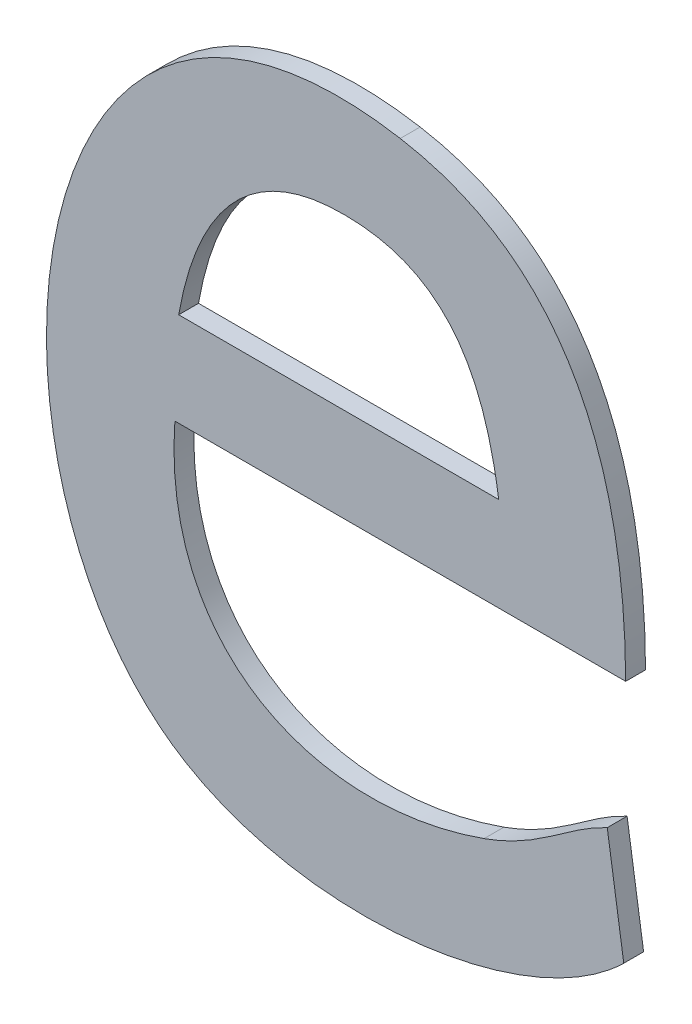
ISO-10303-21;
HEADER;
FILE_DESCRIPTION(('STEP AP214'),'2;1');
FILE_NAME('part.step','',(''),(''),'','','');
FILE_SCHEMA(('AUTOMOTIVE_DESIGN { 1 0 10303 214 1 1 1 1 }'));
ENDSEC;
DATA;
#1=APPLICATION_CONTEXT('core data for automotive mechanical design processes');
#2=APPLICATION_PROTOCOL_DEFINITION('international standard','automotive_design',2000,#1);
#3=PRODUCT_CONTEXT('',#1,'mechanical');
#4=PRODUCT('Part','Part','',(#3));
#5=PRODUCT_RELATED_PRODUCT_CATEGORY('part','',(#4));
#6=PRODUCT_DEFINITION_FORMATION('','',#4);
#7=PRODUCT_DEFINITION_CONTEXT('part definition',#1,'design');
#8=PRODUCT_DEFINITION('design','',#6,#7);
#9=PRODUCT_DEFINITION_SHAPE('','',#8);
#10=(LENGTH_UNIT() NAMED_UNIT(*) SI_UNIT(.MILLI.,.METRE.));
#11=(NAMED_UNIT(*) PLANE_ANGLE_UNIT() SI_UNIT($,.RADIAN.));
#12=(NAMED_UNIT(*) SI_UNIT($,.STERADIAN.) SOLID_ANGLE_UNIT());
#13=UNCERTAINTY_MEASURE_WITH_UNIT(LENGTH_MEASURE(1.E-05),#10,'distance_accuracy_value','');
#14=(GEOMETRIC_REPRESENTATION_CONTEXT(3) GLOBAL_UNCERTAINTY_ASSIGNED_CONTEXT((#13)) GLOBAL_UNIT_ASSIGNED_CONTEXT((#10,
#11,#12)) REPRESENTATION_CONTEXT('',''));
#15=CARTESIAN_POINT('',(0.,0.,0.));
#16=DIRECTION('',(0.,0.,1.));
#17=DIRECTION('',(1.,0.,0.));
#18=AXIS2_PLACEMENT_3D('',#15,#16,#17);
#19=CARTESIAN_POINT('',(-1.892563125,-48.604259609375,0.001));
#20=CARTESIAN_POINT('',(-1.892563125,-48.604259609375,0.));
#21=CARTESIAN_POINT('',(-1.9123662890625,-48.6008684375,0.001));
#22=CARTESIAN_POINT('',(-1.9123662890625,-48.6008684375,0.));
#23=CARTESIAN_POINT('',(-1.91521359375,-48.6298213671875,0.001));
#24=CARTESIAN_POINT('',(-1.91521359375,-48.6298213671875,0.));
#25=CARTESIAN_POINT('',(-1.903376484375,-48.636891640625,0.001));
#26=CARTESIAN_POINT('',(-1.903376484375,-48.636891640625,0.));
#27=B_SPLINE_SURFACE_WITH_KNOTS('',3,1,((#19,#20),(#21,#22),(#23,#24),(#25,#26)),.UNSPECIFIED.,
.F.,.F.,.F.,(4,4),(2,2),(0.5,0.625),(0.,1.),.UNSPECIFIED.);
#28=CARTESIAN_POINT('',(-1.892563125,-48.604259609375,0.));
#29=CARTESIAN_POINT('',(-1.9123662890625,-48.6008684375,0.));
#30=CARTESIAN_POINT('',(-1.91521359375,-48.6298213671875,0.));
#31=CARTESIAN_POINT('',(-1.903376484375,-48.636891640625,0.));
#32=B_SPLINE_CURVE_WITH_KNOTS('',3,(#28,#29,#30,#31),.UNSPECIFIED.,.F.,.F.,(4,4),(0.5,0.625),.UNSPECIFIED.);
#33=CARTESIAN_POINT('',(-1.892563125,-48.604259609375,0.));
#34=VERTEX_POINT('',#33);
#35=CARTESIAN_POINT('',(-1.903376484375,-48.636891640625,0.));
#36=VERTEX_POINT('',#35);
#37=EDGE_CURVE('E11',#34,#36,#32,.T.);
#38=DIRECTION('',(0.,0.,-1.));
#39=VECTOR('',#38,1.);
#40=CARTESIAN_POINT('',(-1.903376484375,-48.636891640625,0.001));
#41=LINE('',#40,#39);
#42=CARTESIAN_POINT('',(-1.903376484375,-48.636891640625,0.001));
#43=VERTEX_POINT('',#42);
#44=EDGE_CURVE('E28',#43,#36,#41,.T.);
#45=CARTESIAN_POINT('',(-1.892563125,-48.604259609375,0.001));
#46=CARTESIAN_POINT('',(-1.9123662890625,-48.6008684375,0.001));
#47=CARTESIAN_POINT('',(-1.91521359375,-48.6298213671875,0.001));
#48=CARTESIAN_POINT('',(-1.903376484375,-48.636891640625,0.001));
#49=B_SPLINE_CURVE_WITH_KNOTS('',3,(#45,#46,#47,#48),.UNSPECIFIED.,.F.,.F.,(4,4),(0.5,0.625),.UNSPECIFIED.);
#50=CARTESIAN_POINT('',(-1.892563125,-48.604259609375,0.001));
#51=VERTEX_POINT('',#50);
#52=EDGE_CURVE('E225',#51,#43,#49,.T.);
#53=DIRECTION('',(0.,0.,-1.));
#54=VECTOR('',#53,1.);
#55=CARTESIAN_POINT('',(-1.892563125,-48.604259609375,0.001));
#56=LINE('',#55,#54);
#57=EDGE_CURVE('E40',#51,#34,#56,.T.);
#58=ORIENTED_EDGE('',*,*,#37,.T.);
#59=ORIENTED_EDGE('',*,*,#44,.F.);
#60=ORIENTED_EDGE('',*,*,#52,.F.);
#61=ORIENTED_EDGE('',*,*,#57,.T.);
#62=EDGE_LOOP('',(#58,#59,#60,#61));
#63=FACE_BOUND('',#62,.T.);
#64=ADVANCED_FACE('F17',(#63),#27,.F.);
#65=CARTESIAN_POINT('',(-1.903376484375,-48.636891640625,0.001));
#66=CARTESIAN_POINT('',(-1.903376484375,-48.636891640625,0.));
#67=CARTESIAN_POINT('',(-1.89704203125,-48.6406987109375,0.001));
#68=CARTESIAN_POINT('',(-1.89704203125,-48.6406987109375,0.));
#69=CARTESIAN_POINT('',(-1.886100703125,-48.639323046875,0.001));
#70=CARTESIAN_POINT('',(-1.886100703125,-48.639323046875,0.));
#71=CARTESIAN_POINT('',(-1.881301875,-48.6346201953125,0.001));
#72=CARTESIAN_POINT('',(-1.881301875,-48.6346201953125,0.));
#73=B_SPLINE_SURFACE_WITH_KNOTS('',3,1,((#65,#66),(#67,#68),(#69,#70),(#71,#72)),.UNSPECIFIED.,
.F.,.F.,.F.,(4,4),(2,2),(0.625,0.75),(0.,1.),.UNSPECIFIED.);
#74=CARTESIAN_POINT('',(-1.903376484375,-48.636891640625,0.));
#75=CARTESIAN_POINT('',(-1.89704203125,-48.6406987109375,0.));
#76=CARTESIAN_POINT('',(-1.886100703125,-48.639323046875,0.));
#77=CARTESIAN_POINT('',(-1.881301875,-48.6346201953125,0.));
#78=B_SPLINE_CURVE_WITH_KNOTS('',3,(#74,#75,#76,#77),.UNSPECIFIED.,.F.,.F.,(4,4),(0.625,0.75),.UNSPECIFIED.);
#79=CARTESIAN_POINT('',(-1.881301875,-48.6346201953125,0.));
#80=VERTEX_POINT('',#79);
#81=EDGE_CURVE('E217',#36,#80,#78,.T.);
#82=DIRECTION('',(0.,0.,-1.));
#83=VECTOR('',#82,1.);
#84=CARTESIAN_POINT('',(-1.881301875,-48.6346201953125,0.001));
#85=LINE('',#84,#83);
#86=CARTESIAN_POINT('',(-1.881301875,-48.6346201953125,0.001));
#87=VERTEX_POINT('',#86);
#88=EDGE_CURVE('E212',#87,#80,#85,.T.);
#89=CARTESIAN_POINT('',(-1.903376484375,-48.636891640625,0.001));
#90=CARTESIAN_POINT('',(-1.89704203125,-48.6406987109375,0.001));
#91=CARTESIAN_POINT('',(-1.886100703125,-48.639323046875,0.001));
#92=CARTESIAN_POINT('',(-1.881301875,-48.6346201953125,0.001));
#93=B_SPLINE_CURVE_WITH_KNOTS('',3,(#89,#90,#91,#92),.UNSPECIFIED.,.F.,.F.,(4,4),(0.625,0.75),.UNSPECIFIED.);
#94=EDGE_CURVE('E208',#43,#87,#93,.T.);
#95=ORIENTED_EDGE('',*,*,#81,.T.);
#96=ORIENTED_EDGE('',*,*,#88,.F.);
#97=ORIENTED_EDGE('',*,*,#94,.F.);
#98=ORIENTED_EDGE('',*,*,#44,.T.);
#99=EDGE_LOOP('',(#95,#96,#97,#98));
#100=FACE_BOUND('',#99,.T.);
#101=ADVANCED_FACE('F235',(#100),#73,.F.);
#102=CARTESIAN_POINT('',(-9.0267830860503,-1.3645137223129,0.001));
#103=DIRECTION('',(-0.988767049205266,-0.149464786508097,0.));
#104=DIRECTION('',(0.149464786508097,-0.988767049205266,0.));
#105=AXIS2_PLACEMENT_3D('',#102,#103,#104);
#106=PLANE('',#105);
#107=DIRECTION('',(-0.149464786508097,0.988767049205266,0.));
#108=VECTOR('',#107,1.);
#109=CARTESIAN_POINT('',(-9.0267830860503,-1.3645137223129,0.));
#110=LINE('',#109,#108);
#111=CARTESIAN_POINT('',(-1.882133671875,-48.6291175390625,0.));
#112=VERTEX_POINT('',#111);
#113=EDGE_CURVE('E206',#80,#112,#110,.T.);
#114=ORIENTED_EDGE('',*,*,#113,.T.);
#115=DIRECTION('',(0.,0.,-1.));
#116=VECTOR('',#115,1.);
#117=CARTESIAN_POINT('',(-1.882133671875,-48.6291175390625,0.001));
#118=LINE('',#117,#116);
#119=CARTESIAN_POINT('',(-1.882133671875,-48.6291175390625,0.001));
#120=VERTEX_POINT('',#119);
#121=EDGE_CURVE('E203',#120,#112,#118,.T.);
#122=ORIENTED_EDGE('',*,*,#121,.F.);
#123=DIRECTION('',(-0.149464786508097,0.988767049205266,0.));
#124=VECTOR('',#123,1.);
#125=CARTESIAN_POINT('',(-9.0267830860503,-1.3645137223129,0.001));
#126=LINE('',#125,#124);
#127=EDGE_CURVE('E197',#87,#120,#126,.T.);
#128=ORIENTED_EDGE('',*,*,#127,.F.);
#129=ORIENTED_EDGE('',*,*,#88,.T.);
#130=EDGE_LOOP('',(#114,#122,#128,#129));
#131=FACE_BOUND('',#130,.T.);
#132=ADVANCED_FACE('F239',(#131),#106,.F.);
#133=CARTESIAN_POINT('',(-1.882133671875,-48.6291175390625,0.001));
#134=CARTESIAN_POINT('',(-1.882133671875,-48.6291175390625,0.));
#135=CARTESIAN_POINT('',(-1.88424515625,-48.630109296875,0.001));
#136=CARTESIAN_POINT('',(-1.88424515625,-48.630109296875,0.));
#137=CARTESIAN_POINT('',(-1.885460859375,-48.6316769140625,0.001));
#138=CARTESIAN_POINT('',(-1.885460859375,-48.6316769140625,0.));
#139=CARTESIAN_POINT('',(-1.88834015625,-48.6327006640625,0.001));
#140=CARTESIAN_POINT('',(-1.88834015625,-48.6327006640625,0.));
#141=B_SPLINE_SURFACE_WITH_KNOTS('',3,1,((#133,#134),(#135,#136),(#137,#138),(#139,#140)),
.UNSPECIFIED.,.F.,.F.,.F.,(4,4),(2,2),(0.,0.125),(0.,1.),.UNSPECIFIED.);
#142=CARTESIAN_POINT('',(-1.882133671875,-48.6291175390625,0.));
#143=CARTESIAN_POINT('',(-1.88424515625,-48.630109296875,0.));
#144=CARTESIAN_POINT('',(-1.885460859375,-48.6316769140625,0.));
#145=CARTESIAN_POINT('',(-1.88834015625,-48.6327006640625,0.));
#146=B_SPLINE_CURVE_WITH_KNOTS('',3,(#142,#143,#144,#145),.UNSPECIFIED.,.F.,.F.,(4,4),(0.,
0.125),.UNSPECIFIED.);
#147=CARTESIAN_POINT('',(-1.88834015625,-48.6327006640625,0.));
#148=VERTEX_POINT('',#147);
#149=EDGE_CURVE('E192',#112,#148,#146,.T.);
#150=DIRECTION('',(0.,0.,-1.));
#151=VECTOR('',#150,1.);
#152=CARTESIAN_POINT('',(-1.88834015625,-48.6327006640625,0.001));
#153=LINE('',#152,#151);
#154=CARTESIAN_POINT('',(-1.88834015625,-48.6327006640625,0.001));
#155=VERTEX_POINT('',#154);
#156=EDGE_CURVE('E187',#155,#148,#153,.T.);
#157=CARTESIAN_POINT('',(-1.882133671875,-48.6291175390625,0.001));
#158=CARTESIAN_POINT('',(-1.88424515625,-48.630109296875,0.001));
#159=CARTESIAN_POINT('',(-1.885460859375,-48.6316769140625,0.001));
#160=CARTESIAN_POINT('',(-1.88834015625,-48.6327006640625,0.001));
#161=B_SPLINE_CURVE_WITH_KNOTS('',3,(#157,#158,#159,#160),.UNSPECIFIED.,.F.,.F.,(4,4),(0.,
0.125),.UNSPECIFIED.);
#162=EDGE_CURVE('E180',#120,#155,#161,.T.);
#163=ORIENTED_EDGE('',*,*,#149,.T.);
#164=ORIENTED_EDGE('',*,*,#156,.F.);
#165=ORIENTED_EDGE('',*,*,#162,.F.);
#166=ORIENTED_EDGE('',*,*,#121,.T.);
#167=EDGE_LOOP('',(#163,#164,#165,#166));
#168=FACE_BOUND('',#167,.T.);
#169=ADVANCED_FACE('F243',(#168),#141,.F.);
#170=CARTESIAN_POINT('',(-1.88834015625,-48.6327006640625,0.001));
#171=CARTESIAN_POINT('',(-1.88834015625,-48.6327006640625,0.));
#172=CARTESIAN_POINT('',(-1.8970100390625,-48.6357719140625,0.001));
#173=CARTESIAN_POINT('',(-1.8970100390625,-48.6357719140625,0.));
#174=CARTESIAN_POINT('',(-1.9046241796875,-48.6320928125,0.001));
#175=CARTESIAN_POINT('',(-1.9046241796875,-48.6320928125,0.));
#176=CARTESIAN_POINT('',(-1.9039203515625,-48.6222712109375,0.001));
#177=CARTESIAN_POINT('',(-1.9039203515625,-48.6222712109375,0.));
#178=B_SPLINE_SURFACE_WITH_KNOTS('',3,1,((#170,#171),(#172,#173),(#174,#175),(#176,#177)),
.UNSPECIFIED.,.F.,.F.,.F.,(4,4),(2,2),(0.125,0.25),(0.,1.),.UNSPECIFIED.);
#179=CARTESIAN_POINT('',(-1.88834015625,-48.6327006640625,0.));
#180=CARTESIAN_POINT('',(-1.8970100390625,-48.6357719140625,0.));
#181=CARTESIAN_POINT('',(-1.9046241796875,-48.6320928125,0.));
#182=CARTESIAN_POINT('',(-1.9039203515625,-48.6222712109375,0.));
#183=B_SPLINE_CURVE_WITH_KNOTS('',3,(#179,#180,#181,#182),.UNSPECIFIED.,.F.,.F.,(4,4),(0.125,
0.25),.UNSPECIFIED.);
#184=CARTESIAN_POINT('',(-1.9039203515625,-48.6222712109375,0.));
#185=VERTEX_POINT('',#184);
#186=EDGE_CURVE('E175',#148,#185,#183,.T.);
#187=DIRECTION('',(0.,0.,-1.));
#188=VECTOR('',#187,1.);
#189=CARTESIAN_POINT('',(-1.9039203515625,-48.6222712109375,0.001));
#190=LINE('',#189,#188);
#191=CARTESIAN_POINT('',(-1.9039203515625,-48.6222712109375,0.001));
#192=VERTEX_POINT('',#191);
#193=EDGE_CURVE('E170',#192,#185,#190,.T.);
#194=CARTESIAN_POINT('',(-1.88834015625,-48.6327006640625,0.001));
#195=CARTESIAN_POINT('',(-1.8970100390625,-48.6357719140625,0.001));
#196=CARTESIAN_POINT('',(-1.9046241796875,-48.6320928125,0.001));
#197=CARTESIAN_POINT('',(-1.9039203515625,-48.6222712109375,0.001));
#198=B_SPLINE_CURVE_WITH_KNOTS('',3,(#194,#195,#196,#197),.UNSPECIFIED.,.F.,.F.,(4,4),(0.125,
0.25),.UNSPECIFIED.);
#199=EDGE_CURVE('E166',#155,#192,#198,.T.);
#200=ORIENTED_EDGE('',*,*,#186,.T.);
#201=ORIENTED_EDGE('',*,*,#193,.F.);
#202=ORIENTED_EDGE('',*,*,#199,.F.);
#203=ORIENTED_EDGE('',*,*,#156,.T.);
#204=EDGE_LOOP('',(#200,#201,#202,#203));
#205=FACE_BOUND('',#204,.T.);
#206=ADVANCED_FACE('F249',(#205),#178,.F.);
#207=CARTESIAN_POINT('',(0.,-48.6222712109375,0.001));
#208=DIRECTION('',(0.,1.,0.));
#209=DIRECTION('',(0.,0.,1.));
#210=AXIS2_PLACEMENT_3D('',#207,#208,#209);
#211=PLANE('',#210);
#212=DIRECTION('',(1.,0.,0.));
#213=VECTOR('',#212,1.);
#214=CARTESIAN_POINT('',(0.,-48.6222712109375,0.));
#215=LINE('',#214,#213);
#216=CARTESIAN_POINT('',(-1.8812058984375,-48.6222712109375,0.));
#217=VERTEX_POINT('',#216);
#218=EDGE_CURVE('E164',#185,#217,#215,.T.);
#219=ORIENTED_EDGE('',*,*,#218,.T.);
#220=DIRECTION('',(0.,0.,-1.));
#221=VECTOR('',#220,1.);
#222=CARTESIAN_POINT('',(-1.8812058984375,-48.6222712109375,0.001));
#223=LINE('',#222,#221);
#224=CARTESIAN_POINT('',(-1.8812058984375,-48.6222712109375,0.001));
#225=VERTEX_POINT('',#224);
#226=EDGE_CURVE('E161',#225,#217,#223,.T.);
#227=ORIENTED_EDGE('',*,*,#226,.F.);
#228=DIRECTION('',(1.,0.,0.));
#229=VECTOR('',#228,1.);
#230=CARTESIAN_POINT('',(0.,-48.6222712109375,0.001));
#231=LINE('',#230,#229);
#232=EDGE_CURVE('E155',#192,#225,#231,.T.);
#233=ORIENTED_EDGE('',*,*,#232,.F.);
#234=ORIENTED_EDGE('',*,*,#193,.T.);
#235=EDGE_LOOP('',(#219,#227,#233,#234));
#236=FACE_BOUND('',#235,.T.);
#237=ADVANCED_FACE('F263',(#236),#211,.F.);
#238=CARTESIAN_POINT('',(-1.9037283984375,-48.6175363671875,0.001));
#239=CARTESIAN_POINT('',(-1.9037283984375,-48.6175363671875,0.));
#240=CARTESIAN_POINT('',(-1.9028966015625,-48.61276953125,0.001));
#241=CARTESIAN_POINT('',(-1.9028966015625,-48.61276953125,0.));
#242=CARTESIAN_POINT('',(-1.9004651953125,-48.60893046875,0.001));
#243=CARTESIAN_POINT('',(-1.9004651953125,-48.60893046875,0.));
#244=CARTESIAN_POINT('',(-1.895314453125,-48.608994453125,0.001));
#245=CARTESIAN_POINT('',(-1.895314453125,-48.608994453125,0.));
#246=B_SPLINE_SURFACE_WITH_KNOTS('',3,1,((#238,#239),(#240,#241),(#242,#243),(#244,#245)),
.UNSPECIFIED.,.F.,.F.,.F.,(4,4),(2,2),(0.,0.25),(0.,1.),.UNSPECIFIED.);
#247=CARTESIAN_POINT('',(-1.9037283984375,-48.6175363671875,0.));
#248=CARTESIAN_POINT('',(-1.9028966015625,-48.61276953125,0.));
#249=CARTESIAN_POINT('',(-1.9004651953125,-48.60893046875,0.));
#250=CARTESIAN_POINT('',(-1.895314453125,-48.608994453125,0.));
#251=B_SPLINE_CURVE_WITH_KNOTS('',3,(#247,#248,#249,#250),.UNSPECIFIED.,.F.,.F.,(4,4),(0.,0.25),.UNSPECIFIED.);
#252=CARTESIAN_POINT('',(-1.9037283984375,-48.6175363671875,0.));
#253=VERTEX_POINT('',#252);
#254=CARTESIAN_POINT('',(-1.895314453125,-48.608994453125,0.));
#255=VERTEX_POINT('',#254);
#256=EDGE_CURVE('E150',#253,#255,#251,.T.);
#257=DIRECTION('',(0.,0.,-1.));
#258=VECTOR('',#257,1.);
#259=CARTESIAN_POINT('',(-1.895314453125,-48.608994453125,0.001));
#260=LINE('',#259,#258);
#261=CARTESIAN_POINT('',(-1.895314453125,-48.608994453125,0.001));
#262=VERTEX_POINT('',#261);
#263=EDGE_CURVE('E145',#262,#255,#260,.T.);
#264=CARTESIAN_POINT('',(-1.9037283984375,-48.6175363671875,0.001));
#265=CARTESIAN_POINT('',(-1.9028966015625,-48.61276953125,0.001));
#266=CARTESIAN_POINT('',(-1.9004651953125,-48.60893046875,0.001));
#267=CARTESIAN_POINT('',(-1.895314453125,-48.608994453125,0.001));
#268=B_SPLINE_CURVE_WITH_KNOTS('',3,(#264,#265,#266,#267),.UNSPECIFIED.,.F.,.F.,(4,4),(0.,0.25),.UNSPECIFIED.);
#269=CARTESIAN_POINT('',(-1.9037283984375,-48.6175363671875,0.001));
#270=VERTEX_POINT('',#269);
#271=EDGE_CURVE('E104',#270,#262,#268,.T.);
#272=DIRECTION('',(0.,0.,-1.));
#273=VECTOR('',#272,1.);
#274=CARTESIAN_POINT('',(-1.9037283984375,-48.6175363671875,0.001));
#275=LINE('',#274,#273);
#276=EDGE_CURVE('E119',#270,#253,#275,.T.);
#277=ORIENTED_EDGE('',*,*,#256,.T.);
#278=ORIENTED_EDGE('',*,*,#263,.F.);
#279=ORIENTED_EDGE('',*,*,#271,.F.);
#280=ORIENTED_EDGE('',*,*,#276,.T.);
#281=EDGE_LOOP('',(#277,#278,#279,#280));
#282=FACE_BOUND('',#281,.T.);
#283=ADVANCED_FACE('F265',(#282),#246,.F.);
#284=CARTESIAN_POINT('',(-1.895314453125,-48.608994453125,0.001));
#285=CARTESIAN_POINT('',(-1.895314453125,-48.608994453125,0.));
#286=CARTESIAN_POINT('',(-1.8901637109375,-48.6090264453125,0.001));
#287=CARTESIAN_POINT('',(-1.8901637109375,-48.6090264453125,0.));
#288=CARTESIAN_POINT('',(-1.8883081640625,-48.6126415625,0.001));
#289=CARTESIAN_POINT('',(-1.8883081640625,-48.6126415625,0.));
#290=CARTESIAN_POINT('',(-1.8876043359375,-48.6175363671875,0.001));
#291=CARTESIAN_POINT('',(-1.8876043359375,-48.6175363671875,0.));
#292=B_SPLINE_SURFACE_WITH_KNOTS('',3,1,((#284,#285),(#286,#287),(#288,#289),(#290,#291)),
.UNSPECIFIED.,.F.,.F.,.F.,(4,4),(2,2),(0.25,0.5),(0.,1.),.UNSPECIFIED.);
#293=CARTESIAN_POINT('',(-1.895314453125,-48.608994453125,0.));
#294=CARTESIAN_POINT('',(-1.8901637109375,-48.6090264453125,0.));
#295=CARTESIAN_POINT('',(-1.8883081640625,-48.6126415625,0.));
#296=CARTESIAN_POINT('',(-1.8876043359375,-48.6175363671875,0.));
#297=B_SPLINE_CURVE_WITH_KNOTS('',3,(#293,#294,#295,#296),.UNSPECIFIED.,.F.,.F.,(4,4),(0.25,
0.5),.UNSPECIFIED.);
#298=CARTESIAN_POINT('',(-1.8876043359375,-48.6175363671875,0.));
#299=VERTEX_POINT('',#298);
#300=EDGE_CURVE('E113',#255,#299,#297,.T.);
#301=DIRECTION('',(0.,0.,-1.));
#302=VECTOR('',#301,1.);
#303=CARTESIAN_POINT('',(-1.8876043359375,-48.6175363671875,0.001));
#304=LINE('',#303,#302);
#305=CARTESIAN_POINT('',(-1.8876043359375,-48.6175363671875,0.001));
#306=VERTEX_POINT('',#305);
#307=EDGE_CURVE('E107',#306,#299,#304,.T.);
#308=CARTESIAN_POINT('',(-1.895314453125,-48.608994453125,0.001));
#309=CARTESIAN_POINT('',(-1.8901637109375,-48.6090264453125,0.001));
#310=CARTESIAN_POINT('',(-1.8883081640625,-48.6126415625,0.001));
#311=CARTESIAN_POINT('',(-1.8876043359375,-48.6175363671875,0.001));
#312=B_SPLINE_CURVE_WITH_KNOTS('',3,(#308,#309,#310,#311),.UNSPECIFIED.,.F.,.F.,(4,4),(0.25,
0.5),.UNSPECIFIED.);
#313=EDGE_CURVE('E97',#262,#306,#312,.T.);
#314=ORIENTED_EDGE('',*,*,#300,.T.);
#315=ORIENTED_EDGE('',*,*,#307,.F.);
#316=ORIENTED_EDGE('',*,*,#313,.F.);
#317=ORIENTED_EDGE('',*,*,#263,.T.);
#318=EDGE_LOOP('',(#314,#315,#316,#317));
#319=FACE_BOUND('',#318,.T.);
#320=ADVANCED_FACE('F111',(#319),#292,.F.);
#321=CARTESIAN_POINT('',(0.,-48.6175363671875,0.001));
#322=DIRECTION('',(0.,-1.,0.));
#323=DIRECTION('',(0.,0.,-1.));
#324=AXIS2_PLACEMENT_3D('',#321,#322,#323);
#325=PLANE('',#324);
#326=DIRECTION('',(-1.,0.,0.));
#327=VECTOR('',#326,1.);
#328=CARTESIAN_POINT('',(0.,-48.6175363671875,0.));
#329=LINE('',#328,#327);
#330=EDGE_CURVE('E108',#299,#253,#329,.T.);
#331=ORIENTED_EDGE('',*,*,#330,.T.);
#332=ORIENTED_EDGE('',*,*,#276,.F.);
#333=DIRECTION('',(-1.,0.,0.));
#334=VECTOR('',#333,1.);
#335=CARTESIAN_POINT('',(0.,-48.6175363671875,0.001));
#336=LINE('',#335,#334);
#337=EDGE_CURVE('E102',#306,#270,#336,.T.);
#338=ORIENTED_EDGE('',*,*,#337,.F.);
#339=ORIENTED_EDGE('',*,*,#307,.T.);
#340=EDGE_LOOP('',(#331,#332,#338,#339));
#341=FACE_BOUND('',#340,.T.);
#342=ADVANCED_FACE('F118',(#341),#325,.F.);
#343=CARTESIAN_POINT('',(-1.8812058984375,-48.6222712109375,0.001));
#344=CARTESIAN_POINT('',(-1.8812058984375,-48.6222712109375,0.));
#345=CARTESIAN_POINT('',(-1.881237890625,-48.6128015234375,0.001));
#346=CARTESIAN_POINT('',(-1.881237890625,-48.6128015234375,0.));
#347=CARTESIAN_POINT('',(-1.884309140625,-48.605667265625,0.001));
#348=CARTESIAN_POINT('',(-1.884309140625,-48.605667265625,0.));
#349=CARTESIAN_POINT('',(-1.892563125,-48.604259609375,0.001));
#350=CARTESIAN_POINT('',(-1.892563125,-48.604259609375,0.));
#351=B_SPLINE_SURFACE_WITH_KNOTS('',3,1,((#343,#344),(#345,#346),(#347,#348),(#349,#350)),
.UNSPECIFIED.,.F.,.F.,.F.,(4,4),(2,2),(0.375,0.5),(0.,1.),.UNSPECIFIED.);
#352=CARTESIAN_POINT('',(-1.8812058984375,-48.6222712109375,0.));
#353=CARTESIAN_POINT('',(-1.881237890625,-48.6128015234375,0.));
#354=CARTESIAN_POINT('',(-1.884309140625,-48.605667265625,0.));
#355=CARTESIAN_POINT('',(-1.892563125,-48.604259609375,0.));
#356=B_SPLINE_CURVE_WITH_KNOTS('',3,(#352,#353,#354,#355),.UNSPECIFIED.,.F.,.F.,(4,4),(0.375,
0.5),.UNSPECIFIED.);
#357=EDGE_CURVE('E120',#217,#34,#356,.T.);
#358=CARTESIAN_POINT('',(-1.8812058984375,-48.6222712109375,0.001));
#359=CARTESIAN_POINT('',(-1.881237890625,-48.6128015234375,0.001));
#360=CARTESIAN_POINT('',(-1.884309140625,-48.605667265625,0.001));
#361=CARTESIAN_POINT('',(-1.892563125,-48.604259609375,0.001));
#362=B_SPLINE_CURVE_WITH_KNOTS('',3,(#358,#359,#360,#361),.UNSPECIFIED.,.F.,.F.,(4,4),(0.375,
0.5),.UNSPECIFIED.);
#363=EDGE_CURVE('E124',#225,#51,#362,.T.);
#364=ORIENTED_EDGE('',*,*,#357,.T.);
#365=ORIENTED_EDGE('',*,*,#57,.F.);
#366=ORIENTED_EDGE('',*,*,#363,.F.);
#367=ORIENTED_EDGE('',*,*,#226,.T.);
#368=EDGE_LOOP('',(#364,#365,#366,#367));
#369=FACE_BOUND('',#368,.T.);
#370=ADVANCED_FACE('F253',(#369),#351,.F.);
#371=CARTESIAN_POINT('',(0.,0.,0.001));
#372=DIRECTION('',(0.,0.,1.));
#373=DIRECTION('',(1.,0.,0.));
#374=AXIS2_PLACEMENT_3D('',#371,#372,#373);
#375=PLANE('',#374);
#376=ORIENTED_EDGE('',*,*,#271,.T.);
#377=ORIENTED_EDGE('',*,*,#313,.T.);
#378=ORIENTED_EDGE('',*,*,#337,.T.);
#379=EDGE_LOOP('',(#376,#377,#378));
#380=FACE_BOUND('',#379,.T.);
#381=ORIENTED_EDGE('',*,*,#52,.T.);
#382=ORIENTED_EDGE('',*,*,#94,.T.);
#383=ORIENTED_EDGE('',*,*,#127,.T.);
#384=ORIENTED_EDGE('',*,*,#162,.T.);
#385=ORIENTED_EDGE('',*,*,#199,.T.);
#386=ORIENTED_EDGE('',*,*,#232,.T.);
#387=ORIENTED_EDGE('',*,*,#363,.T.);
#388=EDGE_LOOP('',(#381,#382,#383,#384,#385,#386,#387));
#389=FACE_BOUND('',#388,.T.);
#390=ADVANCED_FACE('F99',(#380,#389),#375,.T.);
#391=CARTESIAN_POINT('',(0.,0.,0.));
#392=DIRECTION('',(0.,0.,1.));
#393=DIRECTION('',(1.,0.,0.));
#394=AXIS2_PLACEMENT_3D('',#391,#392,#393);
#395=PLANE('',#394);
#396=ORIENTED_EDGE('',*,*,#256,.F.);
#397=ORIENTED_EDGE('',*,*,#330,.F.);
#398=ORIENTED_EDGE('',*,*,#300,.F.);
#399=EDGE_LOOP('',(#396,#397,#398));
#400=FACE_BOUND('',#399,.T.);
#401=ORIENTED_EDGE('',*,*,#37,.F.);
#402=ORIENTED_EDGE('',*,*,#357,.F.);
#403=ORIENTED_EDGE('',*,*,#218,.F.);
#404=ORIENTED_EDGE('',*,*,#186,.F.);
#405=ORIENTED_EDGE('',*,*,#149,.F.);
#406=ORIENTED_EDGE('',*,*,#113,.F.);
#407=ORIENTED_EDGE('',*,*,#81,.F.);
#408=EDGE_LOOP('',(#401,#402,#403,#404,#405,#406,#407));
#409=FACE_BOUND('',#408,.T.);
#410=ADVANCED_FACE('F262',(#400,#409),#395,.F.);
#411=CLOSED_SHELL('',(#64,#101,#132,#169,#206,#237,#283,#320,#342,#370,#390,#410));
#412=MANIFOLD_SOLID_BREP('B1',#411);
#413=ADVANCED_BREP_SHAPE_REPRESENTATION('',(#18,#412),#14);
#414=SHAPE_DEFINITION_REPRESENTATION(#9,#413);
ENDSEC;
END-ISO-10303-21;
